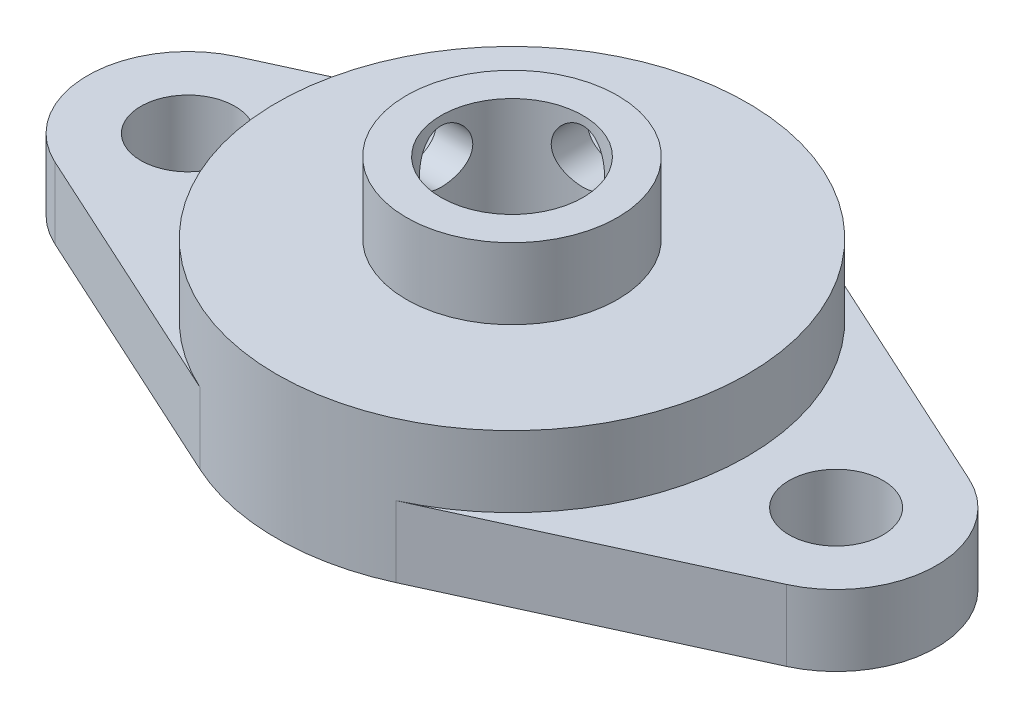
ISO-10303-21;
HEADER;
FILE_DESCRIPTION(('STEP AP214'),'2;1');
FILE_NAME('part.step','',(''),(''),'','','');
FILE_SCHEMA(('AUTOMOTIVE_DESIGN { 1 0 10303 214 1 1 1 1 }'));
ENDSEC;
DATA;
#1=APPLICATION_CONTEXT('core data for automotive mechanical design processes');
#2=APPLICATION_PROTOCOL_DEFINITION('international standard','automotive_design',2000,#1);
#3=PRODUCT_CONTEXT('',#1,'mechanical');
#4=PRODUCT('Part','Part','',(#3));
#5=PRODUCT_RELATED_PRODUCT_CATEGORY('part','',(#4));
#6=PRODUCT_DEFINITION_FORMATION('','',#4);
#7=PRODUCT_DEFINITION_CONTEXT('part definition',#1,'design');
#8=PRODUCT_DEFINITION('design','',#6,#7);
#9=PRODUCT_DEFINITION_SHAPE('','',#8);
#10=(LENGTH_UNIT() NAMED_UNIT(*) SI_UNIT(.MILLI.,.METRE.));
#11=(NAMED_UNIT(*) PLANE_ANGLE_UNIT() SI_UNIT($,.RADIAN.));
#12=(NAMED_UNIT(*) SI_UNIT($,.STERADIAN.) SOLID_ANGLE_UNIT());
#13=UNCERTAINTY_MEASURE_WITH_UNIT(LENGTH_MEASURE(1.E-05),#10,'distance_accuracy_value','');
#14=(GEOMETRIC_REPRESENTATION_CONTEXT(3) GLOBAL_UNCERTAINTY_ASSIGNED_CONTEXT((#13)) GLOBAL_UNIT_ASSIGNED_CONTEXT((#10,
#11,#12)) REPRESENTATION_CONTEXT('',''));
#15=CARTESIAN_POINT('',(0.,0.,0.));
#16=DIRECTION('',(0.,0.,1.));
#17=DIRECTION('',(1.,0.,0.));
#18=AXIS2_PLACEMENT_3D('',#15,#16,#17);
#19=CARTESIAN_POINT('',(0.,8.,0.));
#20=DIRECTION('',(0.,1.,0.));
#21=DIRECTION('',(0.,0.,1.));
#22=AXIS2_PLACEMENT_3D('',#19,#20,#21);
#23=PLANE('',#22);
#24=CARTESIAN_POINT('',(0.,8.,0.));
#25=DIRECTION('',(0.,1.,0.));
#26=DIRECTION('',(0.,0.,1.));
#27=AXIS2_PLACEMENT_3D('',#24,#25,#26);
#28=CIRCLE('',#27,13.25);
#29=CARTESIAN_POINT('',(0.,8.,13.25));
#30=VERTEX_POINT('',#29);
#31=EDGE_CURVE('E188',#30,#30,#28,.T.);
#32=ORIENTED_EDGE('',*,*,#31,.T.);
#33=EDGE_LOOP('',(#32));
#34=FACE_BOUND('',#33,.T.);
#35=CARTESIAN_POINT('',(0.,8.,0.));
#36=DIRECTION('',(0.,1.,0.));
#37=DIRECTION('',(0.,0.,1.));
#38=AXIS2_PLACEMENT_3D('',#35,#36,#37);
#39=CIRCLE('',#38,5.95);
#40=CARTESIAN_POINT('',(0.,8.,5.95));
#41=VERTEX_POINT('',#40);
#42=EDGE_CURVE('E270',#41,#41,#39,.T.);
#43=ORIENTED_EDGE('',*,*,#42,.F.);
#44=EDGE_LOOP('',(#43));
#45=FACE_BOUND('',#44,.T.);
#46=ADVANCED_FACE('F38',(#34,#45),#23,.T.);
#47=CARTESIAN_POINT('',(0.,8.,0.));
#48=DIRECTION('',(0.,-1.,0.));
#49=DIRECTION('',(0.,0.,-1.));
#50=AXIS2_PLACEMENT_3D('',#47,#48,#49);
#51=CYLINDRICAL_SURFACE('',#50,13.25);
#52=ORIENTED_EDGE('',*,*,#31,.F.);
#53=EDGE_LOOP('',(#52));
#54=FACE_BOUND('',#53,.T.);
#55=DIRECTION('',(0.,-1.,0.));
#56=VECTOR('',#55,1.);
#57=CARTESIAN_POINT('',(-5.51780821917808,4.,-12.0464223924106));
#58=LINE('',#57,#56);
#59=CARTESIAN_POINT('',(-5.51780821917808,4.,-12.0464223924106));
#60=VERTEX_POINT('',#59);
#61=CARTESIAN_POINT('',(-5.51780821917808,0.,-12.0464223924106));
#62=VERTEX_POINT('',#61);
#63=EDGE_CURVE('E121',#60,#62,#58,.T.);
#64=ORIENTED_EDGE('',*,*,#63,.F.);
#65=CARTESIAN_POINT('',(0.,4.,0.));
#66=DIRECTION('',(0.,1.,0.));
#67=DIRECTION('',(0.,0.,1.));
#68=AXIS2_PLACEMENT_3D('',#65,#66,#67);
#69=CIRCLE('',#68,13.25);
#70=CARTESIAN_POINT('',(-5.51780821917808,4.,12.0464223924106));
#71=VERTEX_POINT('',#70);
#72=EDGE_CURVE('E11',#60,#71,#69,.T.);
#73=ORIENTED_EDGE('',*,*,#72,.T.);
#74=DIRECTION('',(0.,-1.,0.));
#75=VECTOR('',#74,1.);
#76=CARTESIAN_POINT('',(-5.51780821917808,4.,12.0464223924106));
#77=LINE('',#76,#75);
#78=CARTESIAN_POINT('',(-5.51780821917833,0.,12.0464223924105));
#79=VERTEX_POINT('',#78);
#80=EDGE_CURVE('E277',#71,#79,#77,.T.);
#81=ORIENTED_EDGE('',*,*,#80,.T.);
#82=CARTESIAN_POINT('',(0.,0.,0.));
#83=DIRECTION('',(0.,1.,0.));
#84=DIRECTION('',(0.,0.,1.));
#85=AXIS2_PLACEMENT_3D('',#82,#83,#84);
#86=CIRCLE('',#85,13.25);
#87=CARTESIAN_POINT('',(5.51780821917817,0.,12.0464223924106));
#88=VERTEX_POINT('',#87);
#89=EDGE_CURVE('E187',#79,#88,#86,.T.);
#90=ORIENTED_EDGE('',*,*,#89,.T.);
#91=DIRECTION('',(0.,-1.,0.));
#92=VECTOR('',#91,1.);
#93=CARTESIAN_POINT('',(5.51780821917817,4.,12.0464223924106));
#94=LINE('',#93,#92);
#95=CARTESIAN_POINT('',(5.51780821917825,4.,12.0464223924105));
#96=VERTEX_POINT('',#95);
#97=EDGE_CURVE('E172',#96,#88,#94,.T.);
#98=ORIENTED_EDGE('',*,*,#97,.F.);
#99=CARTESIAN_POINT('',(0.,4.,0.));
#100=DIRECTION('',(0.,-1.,0.));
#101=DIRECTION('',(0.,0.,-1.));
#102=AXIS2_PLACEMENT_3D('',#99,#100,#101);
#103=CIRCLE('',#102,13.25);
#104=CARTESIAN_POINT('',(5.517808219178,4.,-12.0464223924106));
#105=VERTEX_POINT('',#104);
#106=EDGE_CURVE('E53',#105,#96,#103,.T.);
#107=ORIENTED_EDGE('',*,*,#106,.F.);
#108=DIRECTION('',(0.,-1.,0.));
#109=VECTOR('',#108,1.);
#110=CARTESIAN_POINT('',(5.517808219178,4.,-12.0464223924106));
#111=LINE('',#110,#109);
#112=CARTESIAN_POINT('',(5.517808219178,0.,-12.0464223924106));
#113=VERTEX_POINT('',#112);
#114=EDGE_CURVE('E176',#105,#113,#111,.T.);
#115=ORIENTED_EDGE('',*,*,#114,.T.);
#116=EDGE_CURVE('E130',#113,#62,#86,.T.);
#117=ORIENTED_EDGE('',*,*,#116,.T.);
#118=EDGE_LOOP('',(#64,#73,#81,#90,#98,#107,#115,#117));
#119=FACE_BOUND('',#118,.T.);
#120=ADVANCED_FACE('F40',(#54,#119),#51,.T.);
#121=CARTESIAN_POINT('',(0.,0.,0.));
#122=DIRECTION('',(0.,1.,0.));
#123=DIRECTION('',(0.,0.,1.));
#124=AXIS2_PLACEMENT_3D('',#121,#122,#123);
#125=PLANE('',#124);
#126=ORIENTED_EDGE('',*,*,#89,.F.);
#127=DIRECTION('',(0.909163954144185,0.,0.416438356164402));
#128=VECTOR('',#127,1.);
#129=CARTESIAN_POINT('',(-20.6028767123286,0.,5.13677634091438));
#130=LINE('',#129,#128);
#131=CARTESIAN_POINT('',(-20.6028767123287,0.,5.13677634091453));
#132=VERTEX_POINT('',#131);
#133=EDGE_CURVE('E61',#132,#79,#130,.T.);
#134=ORIENTED_EDGE('',*,*,#133,.F.);
#135=CARTESIAN_POINT('',(-18.25,0.,0.));
#136=DIRECTION('',(0.,1.,0.));
#137=DIRECTION('',(0.,0.,1.));
#138=AXIS2_PLACEMENT_3D('',#135,#136,#137);
#139=CIRCLE('',#138,5.64999999999984);
#140=CARTESIAN_POINT('',(-20.6028767123288,0.,-5.1367763409147));
#141=VERTEX_POINT('',#140);
#142=EDGE_CURVE('E279',#141,#132,#139,.T.);
#143=ORIENTED_EDGE('',*,*,#142,.F.);
#144=DIRECTION('',(-0.909163954144194,0.,0.416438356164384));
#145=VECTOR('',#144,1.);
#146=CARTESIAN_POINT('',(-20.6028767123288,0.,-5.1367763409147));
#147=LINE('',#146,#145);
#148=EDGE_CURVE('E266',#62,#141,#147,.T.);
#149=ORIENTED_EDGE('',*,*,#148,.F.);
#150=ORIENTED_EDGE('',*,*,#116,.F.);
#151=DIRECTION('',(-0.909163954144194,0.,-0.416438356164383));
#152=VECTOR('',#151,1.);
#153=CARTESIAN_POINT('',(20.6028767123287,0.,-5.1367763409147));
#154=LINE('',#153,#152);
#155=CARTESIAN_POINT('',(20.6028767123287,0.,-5.1367763409147));
#156=VERTEX_POINT('',#155);
#157=EDGE_CURVE('E164',#156,#113,#154,.T.);
#158=ORIENTED_EDGE('',*,*,#157,.F.);
#159=CARTESIAN_POINT('',(18.25,0.,0.));
#160=DIRECTION('',(0.,1.,0.));
#161=DIRECTION('',(0.,0.,-1.));
#162=AXIS2_PLACEMENT_3D('',#159,#160,#161);
#163=CIRCLE('',#162,5.6499999999999);
#164=CARTESIAN_POINT('',(20.6028767123288,0.,5.13677634091447));
#165=VERTEX_POINT('',#164);
#166=EDGE_CURVE('E147',#165,#156,#163,.T.);
#167=ORIENTED_EDGE('',*,*,#166,.F.);
#168=DIRECTION('',(0.909163954144188,0.,-0.416438356164396));
#169=VECTOR('',#168,1.);
#170=CARTESIAN_POINT('',(20.6028767123288,0.,5.13677634091447));
#171=LINE('',#170,#169);
#172=EDGE_CURVE('E154',#88,#165,#171,.T.);
#173=ORIENTED_EDGE('',*,*,#172,.F.);
#174=EDGE_LOOP('',(#126,#134,#143,#149,#150,#158,#167,#173));
#175=FACE_BOUND('',#174,.T.);
#176=CARTESIAN_POINT('',(0.,0.,0.));
#177=DIRECTION('',(0.,1.,0.));
#178=DIRECTION('',(0.,0.,1.));
#179=AXIS2_PLACEMENT_3D('',#176,#177,#178);
#180=CIRCLE('',#179,4.);
#181=CARTESIAN_POINT('',(0.,0.,4.));
#182=VERTEX_POINT('',#181);
#183=EDGE_CURVE('E183',#182,#182,#180,.T.);
#184=ORIENTED_EDGE('',*,*,#183,.T.);
#185=EDGE_LOOP('',(#184));
#186=FACE_BOUND('',#185,.T.);
#187=CARTESIAN_POINT('',(18.25,0.,0.));
#188=DIRECTION('',(0.,1.,0.));
#189=DIRECTION('',(0.,0.,-1.));
#190=AXIS2_PLACEMENT_3D('',#187,#188,#189);
#191=CIRCLE('',#190,2.65000000000001);
#192=CARTESIAN_POINT('',(18.25,0.,-2.65000000000001));
#193=VERTEX_POINT('',#192);
#194=EDGE_CURVE('E132',#193,#193,#191,.T.);
#195=ORIENTED_EDGE('',*,*,#194,.T.);
#196=EDGE_LOOP('',(#195));
#197=FACE_BOUND('',#196,.T.);
#198=CARTESIAN_POINT('',(-18.25,0.,0.));
#199=DIRECTION('',(0.,1.,0.));
#200=DIRECTION('',(0.,0.,1.));
#201=AXIS2_PLACEMENT_3D('',#198,#199,#200);
#202=CIRCLE('',#201,2.65);
#203=CARTESIAN_POINT('',(-18.25,0.,2.65));
#204=VERTEX_POINT('',#203);
#205=EDGE_CURVE('E258',#204,#204,#202,.T.);
#206=ORIENTED_EDGE('',*,*,#205,.T.);
#207=EDGE_LOOP('',(#206));
#208=FACE_BOUND('',#207,.T.);
#209=ADVANCED_FACE('F236',(#175,#186,#197,#208),#125,.F.);
#210=CARTESIAN_POINT('',(0.,8.,0.));
#211=DIRECTION('',(0.,-1.,0.));
#212=DIRECTION('',(0.,0.,-1.));
#213=AXIS2_PLACEMENT_3D('',#210,#211,#212);
#214=CYLINDRICAL_SURFACE('',#213,4.);
#215=CARTESIAN_POINT('',(-3.70809924354783,10.,-1.5));
#216=CARTESIAN_POINT('',(-3.70809640633806,10.0810074837208,-1.50000304106109));
#217=CARTESIAN_POINT('',(-3.71078260240986,10.1619949225036,-1.49341597549487));
#218=CARTESIAN_POINT('',(-3.72116159304967,10.3215280829132,-1.46736187895468));
#219=CARTESIAN_POINT('',(-3.72885423767112,10.400073877595,-1.44789523373263));
#220=CARTESIAN_POINT('',(-3.748254802809,10.5523753716135,-1.39689657610574));
#221=CARTESIAN_POINT('',(-3.7599530956926,10.6261420566511,-1.36539347266348));
#222=CARTESIAN_POINT('',(-3.78603134206598,10.7673718968188,-1.29131856742698));
#223=CARTESIAN_POINT('',(-3.80041210067323,10.8348331502825,-1.24874344095039));
#224=CARTESIAN_POINT('',(-3.83103574665713,10.9648903116228,-1.15146661374162));
#225=CARTESIAN_POINT('',(-3.84733341923603,11.0271285296294,-1.09630381213306));
#226=CARTESIAN_POINT('',(-3.87949750628547,11.1417228146715,-0.976395839778926));
#227=CARTESIAN_POINT('',(-3.89536382814785,11.1940767737419,-0.91164863025668));
#228=CARTESIAN_POINT('',(-3.92552873936553,11.2891395122956,-0.7716946551776));
#229=CARTESIAN_POINT('',(-3.93975561223505,11.3314594747159,-0.696206947538028));
#230=CARTESIAN_POINT('',(-3.96438007973848,11.4026511725249,-0.538555771965247));
#231=CARTESIAN_POINT('',(-3.97477900217006,11.431527571992,-0.456394630933536));
#232=CARTESIAN_POINT('',(-3.9901869710344,11.4737578957746,-0.291489341676832));
#233=CARTESIAN_POINT('',(-3.99540915214774,11.4877276274405,-0.208923197281597));
#234=CARTESIAN_POINT('',(-4.0006401410794,11.501721200945,-0.0424643637947865));
#235=CARTESIAN_POINT('',(-4.00065064414902,11.5017495776187,0.0414278850628325));
#236=CARTESIAN_POINT('',(-3.99559265903894,11.4882182385348,0.203743543064475));
#237=CARTESIAN_POINT('',(-3.99077541996683,11.4753307020512,0.282232178266899));
#238=CARTESIAN_POINT('',(-3.97693274932263,11.4374640847745,0.435839217984391));
#239=CARTESIAN_POINT('',(-3.96790701975578,11.412484147738,0.510957383430298));
#240=CARTESIAN_POINT('',(-3.94637769167531,11.3508295483242,0.656989017303104));
#241=CARTESIAN_POINT('',(-3.93382539470077,11.3139899947316,0.727825392287309));
#242=CARTESIAN_POINT('',(-3.90651310225279,11.2298079030706,0.86248660795756));
#243=CARTESIAN_POINT('',(-3.8917523951284,11.1824619769824,0.926309176932323));
#244=CARTESIAN_POINT('',(-3.86052529655816,11.0753727137168,1.04909048680094));
#245=CARTESIAN_POINT('',(-3.84400963763883,11.0150660843496,1.10754614526348));
#246=CARTESIAN_POINT('',(-3.81182460645722,10.8854070066785,1.21370395569342));
#247=CARTESIAN_POINT('',(-3.79615544748847,10.8160522934134,1.261403406929));
#248=CARTESIAN_POINT('',(-3.76712703500335,10.6682805325372,1.34565611808151));
#249=CARTESIAN_POINT('',(-3.75382677150277,10.5896965063139,1.38193847851831));
#250=CARTESIAN_POINT('',(-3.73172438629002,10.4269037748324,1.44056464441501));
#251=CARTESIAN_POINT('',(-3.72291976205783,10.3426982284063,1.46291620605595));
#252=CARTESIAN_POINT('',(-3.71139597222848,10.1760240376841,1.49190191709668));
#253=CARTESIAN_POINT('',(-3.70836785241537,10.0937158944639,1.49933521158966));
#254=CARTESIAN_POINT('',(-3.70786539525016,9.92899064325827,1.50057885636272));
#255=CARTESIAN_POINT('',(-3.71038967003987,9.84657356764754,1.49439261093762));
#256=CARTESIAN_POINT('',(-3.72039381629735,9.68807007771233,1.46929733520157));
#257=CARTESIAN_POINT('',(-3.72763276216449,9.61186886423535,1.45100618334225));
#258=CARTESIAN_POINT('',(-3.74596487046361,9.46365205527982,1.40299774640638));
#259=CARTESIAN_POINT('',(-3.75705882250173,9.39163732083188,1.37327812034623));
#260=CARTESIAN_POINT('',(-3.7823624311608,9.25083556192381,1.30200292275278));
#261=CARTESIAN_POINT('',(-3.79667328892065,9.18227070786267,1.26004545177047));
#262=CARTESIAN_POINT('',(-3.82662814294291,9.05287101827397,1.16591317862479));
#263=CARTESIAN_POINT('',(-3.84227262594077,8.99203902537538,1.11373463696435));
#264=CARTESIAN_POINT('',(-3.87433046553184,8.87583162680491,0.996727340900939));
#265=CARTESIAN_POINT('',(-3.89072969357027,8.82104659123126,0.931306341491062));
#266=CARTESIAN_POINT('',(-3.92149874963302,8.72316163241057,0.791797471753152));
#267=CARTESIAN_POINT('',(-3.93586857107664,8.68006174705417,0.717709573322674));
#268=CARTESIAN_POINT('',(-3.96094985704552,8.6070539438004,0.563016329468478));
#269=CARTESIAN_POINT('',(-3.9716738133801,8.57710087620741,0.482434433064629));
#270=CARTESIAN_POINT('',(-3.98829436712571,8.53134358615009,0.316881887523257));
#271=CARTESIAN_POINT('',(-3.99419323299412,8.51553271457761,0.231913320723595));
#272=CARTESIAN_POINT('',(-4.00028407317073,8.49922559724518,0.0653355852738168));
#273=CARTESIAN_POINT('',(-4.00078860953764,8.49789051694102,-0.0161807680608443));
#274=CARTESIAN_POINT('',(-3.99684889809224,8.5084151594454,-0.178226786412423));
#275=CARTESIAN_POINT('',(-3.9924052471313,8.52027329088587,-0.258756569245256));
#276=CARTESIAN_POINT('',(-3.97921089603771,8.55625885149363,-0.414548248377125));
#277=CARTESIAN_POINT('',(-3.97056791378017,8.58007990587836,-0.489890731068834));
#278=CARTESIAN_POINT('',(-3.9498778362099,8.63901001338437,-0.635515473006389));
#279=CARTESIAN_POINT('',(-3.93783009655664,8.67412120330476,-0.705796771275542));
#280=CARTESIAN_POINT('',(-3.91090618300074,8.75631394350482,-0.842540176994411));
#281=CARTESIAN_POINT('',(-3.89593240108828,8.80383664051416,-0.908717548846848));
#282=CARTESIAN_POINT('',(-3.86499507694844,8.90880783018761,-1.03241734752336));
#283=CARTESIAN_POINT('',(-3.84903118274027,8.96625986580788,-1.0899366712559));
#284=CARTESIAN_POINT('',(-3.81688129739175,9.09306413164507,-1.19781214236196));
#285=CARTESIAN_POINT('',(-3.8007280534916,9.16288440215432,-1.24762999816025));
#286=CARTESIAN_POINT('',(-3.77098325003638,9.31041586957333,-1.33484709556843));
#287=CARTESIAN_POINT('',(-3.75739195631216,9.38812788405349,-1.37224504878157));
#288=CARTESIAN_POINT('',(-3.73402269853266,9.55295568097541,-1.4346588697426));
#289=CARTESIAN_POINT('',(-3.7244380329086,9.64033436651179,-1.45906002899523));
#290=CARTESIAN_POINT('',(-3.71147994336315,9.8184852719558,-1.49172356722079));
#291=CARTESIAN_POINT('',(-3.70810242179736,9.90925521271,-1.49999659339571));
#292=CARTESIAN_POINT('',(-3.70809924354783,10.,-1.5));
#293=B_SPLINE_CURVE_WITH_KNOTS('',3,(#215,#216,#217,#218,#219,#220,#221,#222,#223,#224,#225,
#226,#227,#228,#229,#230,#231,#232,#233,#234,#235,#236,#237,#238,#239,#240,#241,#242,#243,#244,
#245,#246,#247,#248,#249,#250,#251,#252,#253,#254,#255,#256,#257,#258,#259,#260,#261,#262,#263,
#264,#265,#266,#267,#268,#269,#270,#271,#272,#273,#274,#275,#276,#277,#278,#279,#280,#281,#282,
#283,#284,#285,#286,#287,#288,#289,#290,#291,#292),.UNSPECIFIED.,.T.,.F.,(4,2,2,2,2,2,2,2,2,2,2,
2,2,2,2,2,2,2,2,2,2,2,2,2,2,2,2,2,2,2,2,2,2,2,2,2,2,2,4),(0.,0.242684541416169,
0.485361814598854,0.727459856757029,0.969630679682933,1.22274652401128,1.47591628822983,
1.73770072136421,1.9993942638133,2.24980018489679,2.50012465404857,2.73806472803194,
2.97602165263335,3.21744131210668,3.45893893628976,3.71456675065874,3.97025867827334,
4.23162592252966,4.49284751635474,4.73965657740485,4.98640395388884,5.22143845928199,
5.45652113429526,5.70041561005821,5.94439948466355,6.20385016993624,6.46330169650178,
6.72185508890168,6.98028685560127,7.22365720549936,7.4669982031948,7.70440274003891,
7.94185223512831,8.18928323676987,8.43680270894965,8.69738599542079,8.95799630544242,
9.23003178870926,9.50188762323054),.UNSPECIFIED.);
#294=CARTESIAN_POINT('',(-3.70809924354783,10.,-1.5));
#295=VERTEX_POINT('',#294);
#296=EDGE_CURVE('E203',#295,#295,#293,.T.);
#297=ORIENTED_EDGE('',*,*,#296,.F.);
#298=EDGE_LOOP('',(#297));
#299=FACE_BOUND('',#298,.T.);
#300=CARTESIAN_POINT('',(0.,11.5,-4.));
#301=CARTESIAN_POINT('',(-0.0812350589378528,11.5000029023031,-4.00000217456151));
#302=CARTESIAN_POINT('',(-0.162450241781792,11.4933802397516,-3.99750379283184));
#303=CARTESIAN_POINT('',(-0.322453452352361,11.4671718047301,-3.98778696006928));
#304=CARTESIAN_POINT('',(-0.401241827987615,11.4475878995294,-3.98056918893993));
#305=CARTESIAN_POINT('',(-0.554060784990879,11.3962469982282,-3.96218832391545));
#306=CARTESIAN_POINT('',(-0.628100224162279,11.3645134831782,-3.9510328434944));
#307=CARTESIAN_POINT('',(-0.769799310160254,11.2898935869842,-3.92588767765353));
#308=CARTESIAN_POINT('',(-0.837457239177879,11.2470042144559,-3.91189723227548));
#309=CARTESIAN_POINT('',(-0.967346417045825,11.1493874689291,-3.88186246971217));
#310=CARTESIAN_POINT('',(-1.02927073015119,11.0942697377406,-3.86576002583566));
#311=CARTESIAN_POINT('',(-1.14324421474363,10.9745895653412,-3.83360220871327));
#312=CARTESIAN_POINT('',(-1.19529036359203,10.9100242439121,-3.81754685135033));
#313=CARTESIAN_POINT('',(-1.28998202215985,10.7702825324768,-3.78662470617731));
#314=CARTESIAN_POINT('',(-1.3321939319576,10.6947956334542,-3.77182648820818));
#315=CARTESIAN_POINT('',(-1.40318646334084,10.5371516458315,-3.74599860237433));
#316=CARTESIAN_POINT('',(-1.43197244961239,10.4549972368449,-3.73496742975881));
#317=CARTESIAN_POINT('',(-1.47408431017549,10.2898832597418,-3.71854412824136));
#318=CARTESIAN_POINT('',(-1.48799593218558,10.2070949615646,-3.71293924350838));
#319=CARTESIAN_POINT('',(-1.50179556531648,10.0401838420062,-3.70738061461215));
#320=CARTESIAN_POINT('',(-1.5016893680263,9.95606158612554,-3.70742453659305));
#321=CARTESIAN_POINT('',(-1.48790429610018,9.79423047478705,-3.71297511632055));
#322=CARTESIAN_POINT('',(-1.47503808509003,9.71643909395583,-3.71815468871122));
#323=CARTESIAN_POINT('',(-1.4374416786833,9.56421284959469,-3.73284938059529));
#324=CARTESIAN_POINT('',(-1.41270969663258,9.48977849338613,-3.74236515298863));
#325=CARTESIAN_POINT('',(-1.35163748571904,9.34472293227178,-3.76485702190253));
#326=CARTESIAN_POINT('',(-1.31508648737101,9.27420051387871,-3.77789517988166));
#327=CARTESIAN_POINT('',(-1.23156073762698,9.14005426240904,-3.80594210139319));
#328=CARTESIAN_POINT('',(-1.18458238728897,9.07643282248031,-3.82095154457158));
#329=CARTESIAN_POINT('',(-1.07781780766549,8.95339633634913,-3.85248038859113));
#330=CARTESIAN_POINT('',(-1.01738298716956,8.89455135925192,-3.86903347455671));
#331=CARTESIAN_POINT('',(-0.887312590819021,8.78766203379421,-3.90091728164085));
#332=CARTESIAN_POINT('',(-0.817675603497365,8.73961934539434,-3.91624781465952));
#333=CARTESIAN_POINT('',(-0.66972343699242,8.65506960293749,-3.9442639480908));
#334=CARTESIAN_POINT('',(-0.591290713844719,8.61875241877895,-3.95690498259616));
#335=CARTESIAN_POINT('',(-0.428836850524583,8.56001739572997,-3.97778718326962));
#336=CARTESIAN_POINT('',(-0.344818210845767,8.53759338343889,-3.98603030341493));
#337=CARTESIAN_POINT('',(-0.178375243148665,8.50837721245807,-3.99684443228065));
#338=CARTESIAN_POINT('',(-0.0961036195622094,8.5008173936175,-3.99969369025686));
#339=CARTESIAN_POINT('',(0.068572475255024,8.49930893610009,-4.00025893700126));
#340=CARTESIAN_POINT('',(0.150976912983372,8.50535727968323,-3.99797606386863));
#341=CARTESIAN_POINT('',(0.310262048561859,8.53031004230868,-3.98871709772643));
#342=CARTESIAN_POINT('',(0.387233328007335,8.54871154373709,-3.98192470962305));
#343=CARTESIAN_POINT('',(0.53694175495722,8.59718607254733,-3.96451477091717));
#344=CARTESIAN_POINT('',(0.609678350347534,8.62726061794804,-3.9538967228203));
#345=CARTESIAN_POINT('',(0.751247765110155,8.69918641243948,-3.92949624407681));
#346=CARTESIAN_POINT('',(0.819903083557796,8.74135772922339,-3.91563000209348));
#347=CARTESIAN_POINT('',(0.949392711726626,8.83591810317157,-3.88626671564664));
#348=CARTESIAN_POINT('',(1.01022412027045,8.88831093254516,-3.87076907009516));
#349=CARTESIAN_POINT('',(1.12603079874454,9.00540412212428,-3.8387332949099));
#350=CARTESIAN_POINT('',(1.18046154123569,9.07064218277271,-3.82218696503729));
#351=CARTESIAN_POINT('',(1.27771050031903,9.20965138470766,-3.79078815746854));
#352=CARTESIAN_POINT('',(1.32052767414518,9.28342329138851,-3.77593583194399));
#353=CARTESIAN_POINT('',(1.39337773518998,9.43801598677232,-3.74966829822463));
#354=CARTESIAN_POINT('',(1.42335685446918,9.51886474591044,-3.73826760328493));
#355=CARTESIAN_POINT('',(1.46907883466889,9.68500976368783,-3.72054032891005));
#356=CARTESIAN_POINT('',(1.48483050305535,9.77030323619813,-3.71421061057491));
#357=CARTESIAN_POINT('',(1.50086347097839,9.93701615954112,-3.70775894792573));
#358=CARTESIAN_POINT('',(1.50207331495837,10.0183326317169,-3.70726444523341));
#359=CARTESIAN_POINT('',(1.49136715641593,10.1799453162762,-3.71158412745292));
#360=CARTESIAN_POINT('',(1.47945239850124,10.2602416246716,-3.71639780898899));
#361=CARTESIAN_POINT('',(1.44355815630242,10.4150472267166,-3.73048141585432));
#362=CARTESIAN_POINT('',(1.41995798316524,10.4896583462454,-3.73961085376663));
#363=CARTESIAN_POINT('',(1.3616969677992,10.6339055084944,-3.76121548297845));
#364=CARTESIAN_POINT('',(1.32703332944945,10.7035402880702,-3.77369151995215));
#365=CARTESIAN_POINT('',(1.24552075938154,10.8398267896976,-3.80139723903965));
#366=CARTESIAN_POINT('',(1.1981283280301,10.9061307967999,-3.81673698440964));
#367=CARTESIAN_POINT('',(1.09334485729906,11.0301415609712,-3.84806246757177));
#368=CARTESIAN_POINT('',(1.03595064012808,11.0878455747868,-3.86404840943145));
#369=CARTESIAN_POINT('',(0.909080396784623,11.1962019558219,-3.89590424609881));
#370=CARTESIAN_POINT('',(0.839118644212993,11.2463037534347,-3.91172104900645));
#371=CARTESIAN_POINT('',(0.691213223200821,11.3340226552766,-3.94054514457031));
#372=CARTESIAN_POINT('',(0.613268934090621,11.3716387877364,-3.95355221851559));
#373=CARTESIAN_POINT('',(0.447999082002311,11.4343768290483,-3.9757429260668));
#374=CARTESIAN_POINT('',(0.360413422234207,11.4588870646019,-3.98473657158356));
#375=CARTESIAN_POINT('',(0.181875733606381,11.4916929599207,-3.99686242179587));
#376=CARTESIAN_POINT('',(0.0909254163648585,11.4999967514873,-3.99999756603967));
#377=CARTESIAN_POINT('',(0.,11.5,-4.));
#378=B_SPLINE_CURVE_WITH_KNOTS('',3,(#300,#301,#302,#303,#304,#305,#306,#307,#308,#309,#310,
#311,#312,#313,#314,#315,#316,#317,#318,#319,#320,#321,#322,#323,#324,#325,#326,#327,#328,#329,
#330,#331,#332,#333,#334,#335,#336,#337,#338,#339,#340,#341,#342,#343,#344,#345,#346,#347,#348,
#349,#350,#351,#352,#353,#354,#355,#356,#357,#358,#359,#360,#361,#362,#363,#364,#365,#366,#367,
#368,#369,#370,#371,#372,#373,#374,#375,#376,#377),.UNSPECIFIED.,.T.,.F.,(4,2,2,2,2,2,2,2,2,2,2,
2,2,2,2,2,2,2,2,2,2,2,2,2,2,2,2,2,2,2,2,2,2,2,2,2,2,2,4),(0.,0.243369801560559,0.48670454953046,
0.729571369213574,0.972503379609489,1.22473618582715,1.47704604925622,1.73896674501658,
2.00078269352134,2.25185874416901,2.50283106079707,2.73878345119971,2.97477138060589,
3.21522408387018,3.45575990744258,3.71246153335813,3.96920257905066,4.22991375286075,
4.49050899698846,4.73725019635925,4.9839366839052,5.2211443792384,5.45838293254453,
5.702592218596,5.94689180019868,6.20536519455658,6.46386178920141,6.72343066727204,
6.98283874956507,7.22558763480252,7.46831350211259,7.70363142426534,7.93900886656506,
8.18672471884271,8.43451941997062,8.69572329654039,8.95694749805102,9.22948515032042,
9.50188601796127),.UNSPECIFIED.);
#379=CARTESIAN_POINT('',(0.,11.5,-4.));
#380=VERTEX_POINT('',#379);
#381=EDGE_CURVE('E202',#380,#380,#378,.T.);
#382=ORIENTED_EDGE('',*,*,#381,.F.);
#383=EDGE_LOOP('',(#382));
#384=FACE_BOUND('',#383,.T.);
#385=ORIENTED_EDGE('',*,*,#183,.F.);
#386=EDGE_LOOP('',(#385));
#387=FACE_BOUND('',#386,.T.);
#388=CARTESIAN_POINT('',(0.,12.,0.));
#389=DIRECTION('',(0.,1.,0.));
#390=DIRECTION('',(0.,0.,1.));
#391=AXIS2_PLACEMENT_3D('',#388,#389,#390);
#392=CIRCLE('',#391,4.);
#393=CARTESIAN_POINT('',(0.,12.,4.));
#394=VERTEX_POINT('',#393);
#395=EDGE_CURVE('E225',#394,#394,#392,.T.);
#396=ORIENTED_EDGE('',*,*,#395,.T.);
#397=EDGE_LOOP('',(#396));
#398=FACE_BOUND('',#397,.T.);
#399=ADVANCED_FACE('F230',(#299,#384,#387,#398),#214,.F.);
#400=CARTESIAN_POINT('',(18.25,4.,0.));
#401=DIRECTION('',(0.,-1.,0.));
#402=DIRECTION('',(0.,0.,-1.));
#403=AXIS2_PLACEMENT_3D('',#400,#401,#402);
#404=PLANE('',#403);
#405=DIRECTION('',(-0.909163954144194,0.,-0.416438356164383));
#406=VECTOR('',#405,1.);
#407=CARTESIAN_POINT('',(20.6028767123287,4.,-5.1367763409147));
#408=LINE('',#407,#406);
#409=CARTESIAN_POINT('',(20.6028767123287,4.,-5.1367763409147));
#410=VERTEX_POINT('',#409);
#411=EDGE_CURVE('E153',#410,#105,#408,.T.);
#412=ORIENTED_EDGE('',*,*,#411,.T.);
#413=ORIENTED_EDGE('',*,*,#106,.T.);
#414=DIRECTION('',(0.909163954144188,0.,-0.416438356164396));
#415=VECTOR('',#414,1.);
#416=CARTESIAN_POINT('',(20.6028767123288,4.,5.13677634091447));
#417=LINE('',#416,#415);
#418=CARTESIAN_POINT('',(20.6028767123288,4.,5.13677634091447));
#419=VERTEX_POINT('',#418);
#420=EDGE_CURVE('E157',#96,#419,#417,.T.);
#421=ORIENTED_EDGE('',*,*,#420,.T.);
#422=CARTESIAN_POINT('',(18.25,4.,0.));
#423=DIRECTION('',(0.,1.,0.));
#424=DIRECTION('',(0.,0.,-1.));
#425=AXIS2_PLACEMENT_3D('',#422,#423,#424);
#426=CIRCLE('',#425,5.6499999999999);
#427=EDGE_CURVE('E149',#419,#410,#426,.T.);
#428=ORIENTED_EDGE('',*,*,#427,.T.);
#429=EDGE_LOOP('',(#412,#413,#421,#428));
#430=FACE_BOUND('',#429,.T.);
#431=CARTESIAN_POINT('',(18.25,4.,0.));
#432=DIRECTION('',(0.,1.,0.));
#433=DIRECTION('',(0.,0.,-1.));
#434=AXIS2_PLACEMENT_3D('',#431,#432,#433);
#435=CIRCLE('',#434,2.65000000000001);
#436=CARTESIAN_POINT('',(18.25,4.,-2.65000000000001));
#437=VERTEX_POINT('',#436);
#438=EDGE_CURVE('E138',#437,#437,#435,.T.);
#439=ORIENTED_EDGE('',*,*,#438,.F.);
#440=EDGE_LOOP('',(#439));
#441=FACE_BOUND('',#440,.T.);
#442=ADVANCED_FACE('F235',(#430,#441),#404,.F.);
#443=CARTESIAN_POINT('',(18.25,4.,0.));
#444=DIRECTION('',(0.,-1.,0.));
#445=DIRECTION('',(0.,0.,-1.));
#446=AXIS2_PLACEMENT_3D('',#443,#444,#445);
#447=CYLINDRICAL_SURFACE('',#446,5.6499999999999);
#448=ORIENTED_EDGE('',*,*,#166,.T.);
#449=DIRECTION('',(0.,-1.,0.));
#450=VECTOR('',#449,1.);
#451=CARTESIAN_POINT('',(20.6028767123287,4.,-5.1367763409147));
#452=LINE('',#451,#450);
#453=EDGE_CURVE('E179',#410,#156,#452,.T.);
#454=ORIENTED_EDGE('',*,*,#453,.F.);
#455=ORIENTED_EDGE('',*,*,#427,.F.);
#456=DIRECTION('',(0.,-1.,0.));
#457=VECTOR('',#456,1.);
#458=CARTESIAN_POINT('',(20.6028767123288,4.,5.13677634091447));
#459=LINE('',#458,#457);
#460=EDGE_CURVE('E160',#419,#165,#459,.T.);
#461=ORIENTED_EDGE('',*,*,#460,.T.);
#462=EDGE_LOOP('',(#448,#454,#455,#461));
#463=FACE_BOUND('',#462,.T.);
#464=ADVANCED_FACE('F238',(#463),#447,.T.);
#465=CARTESIAN_POINT('',(20.6028767123287,4.,-5.1367763409147));
#466=DIRECTION('',(-0.416438356164383,0.,0.909163954144194));
#467=DIRECTION('',(0.909163954144194,0.,0.416438356164383));
#468=AXIS2_PLACEMENT_3D('',#465,#466,#467);
#469=PLANE('',#468);
#470=ORIENTED_EDGE('',*,*,#157,.T.);
#471=ORIENTED_EDGE('',*,*,#114,.F.);
#472=ORIENTED_EDGE('',*,*,#411,.F.);
#473=ORIENTED_EDGE('',*,*,#453,.T.);
#474=EDGE_LOOP('',(#470,#471,#472,#473));
#475=FACE_BOUND('',#474,.T.);
#476=ADVANCED_FACE('F312',(#475),#469,.F.);
#477=CARTESIAN_POINT('',(20.6028767123288,4.,5.13677634091447));
#478=DIRECTION('',(-0.416438356164396,0.,-0.909163954144188));
#479=DIRECTION('',(-0.909163954144188,0.,0.416438356164396));
#480=AXIS2_PLACEMENT_3D('',#477,#478,#479);
#481=PLANE('',#480);
#482=ORIENTED_EDGE('',*,*,#172,.T.);
#483=ORIENTED_EDGE('',*,*,#460,.F.);
#484=ORIENTED_EDGE('',*,*,#420,.F.);
#485=ORIENTED_EDGE('',*,*,#97,.T.);
#486=EDGE_LOOP('',(#482,#483,#484,#485));
#487=FACE_BOUND('',#486,.T.);
#488=ADVANCED_FACE('F306',(#487),#481,.F.);
#489=CARTESIAN_POINT('',(18.25,4.,0.));
#490=DIRECTION('',(0.,-1.,0.));
#491=DIRECTION('',(0.,0.,-1.));
#492=AXIS2_PLACEMENT_3D('',#489,#490,#491);
#493=CYLINDRICAL_SURFACE('',#492,2.65000000000001);
#494=ORIENTED_EDGE('',*,*,#438,.T.);
#495=EDGE_LOOP('',(#494));
#496=FACE_BOUND('',#495,.T.);
#497=ORIENTED_EDGE('',*,*,#194,.F.);
#498=EDGE_LOOP('',(#497));
#499=FACE_BOUND('',#498,.T.);
#500=ADVANCED_FACE('F303',(#496,#499),#493,.F.);
#501=CARTESIAN_POINT('',(-18.25,4.,0.));
#502=DIRECTION('',(0.,1.,0.));
#503=DIRECTION('',(0.,0.,1.));
#504=AXIS2_PLACEMENT_3D('',#501,#502,#503);
#505=PLANE('',#504);
#506=ORIENTED_EDGE('',*,*,#72,.F.);
#507=DIRECTION('',(-0.909163954144194,0.,0.416438356164384));
#508=VECTOR('',#507,1.);
#509=CARTESIAN_POINT('',(-20.6028767123288,4.,-5.1367763409147));
#510=LINE('',#509,#508);
#511=CARTESIAN_POINT('',(-20.6028767123288,4.,-5.1367763409147));
#512=VERTEX_POINT('',#511);
#513=EDGE_CURVE('E113',#60,#512,#510,.T.);
#514=ORIENTED_EDGE('',*,*,#513,.T.);
#515=CARTESIAN_POINT('',(-18.25,4.,0.));
#516=DIRECTION('',(0.,1.,0.));
#517=DIRECTION('',(0.,0.,1.));
#518=AXIS2_PLACEMENT_3D('',#515,#516,#517);
#519=CIRCLE('',#518,5.64999999999984);
#520=CARTESIAN_POINT('',(-20.6028767123287,4.,5.13677634091453));
#521=VERTEX_POINT('',#520);
#522=EDGE_CURVE('E127',#512,#521,#519,.T.);
#523=ORIENTED_EDGE('',*,*,#522,.T.);
#524=DIRECTION('',(0.909163954144185,0.,0.416438356164402));
#525=VECTOR('',#524,1.);
#526=CARTESIAN_POINT('',(-20.6028767123286,4.,5.13677634091438));
#527=LINE('',#526,#525);
#528=EDGE_CURVE('E116',#521,#71,#527,.T.);
#529=ORIENTED_EDGE('',*,*,#528,.T.);
#530=EDGE_LOOP('',(#506,#514,#523,#529));
#531=FACE_BOUND('',#530,.T.);
#532=CARTESIAN_POINT('',(-18.25,4.,0.));
#533=DIRECTION('',(0.,1.,0.));
#534=DIRECTION('',(0.,0.,1.));
#535=AXIS2_PLACEMENT_3D('',#532,#533,#534);
#536=CIRCLE('',#535,2.65);
#537=CARTESIAN_POINT('',(-18.25,4.,2.65));
#538=VERTEX_POINT('',#537);
#539=EDGE_CURVE('E260',#538,#538,#536,.T.);
#540=ORIENTED_EDGE('',*,*,#539,.F.);
#541=EDGE_LOOP('',(#540));
#542=FACE_BOUND('',#541,.T.);
#543=ADVANCED_FACE('F111',(#531,#542),#505,.T.);
#544=CARTESIAN_POINT('',(-20.6028767123288,4.,-5.1367763409147));
#545=DIRECTION('',(0.416438356164384,0.,0.909163954144194));
#546=DIRECTION('',(0.909163954144194,0.,-0.416438356164384));
#547=AXIS2_PLACEMENT_3D('',#544,#545,#546);
#548=PLANE('',#547);
#549=ORIENTED_EDGE('',*,*,#148,.T.);
#550=DIRECTION('',(0.,-1.,0.));
#551=VECTOR('',#550,1.);
#552=CARTESIAN_POINT('',(-20.6028767123288,4.,-5.1367763409147));
#553=LINE('',#552,#551);
#554=EDGE_CURVE('E124',#512,#141,#553,.T.);
#555=ORIENTED_EDGE('',*,*,#554,.F.);
#556=ORIENTED_EDGE('',*,*,#513,.F.);
#557=ORIENTED_EDGE('',*,*,#63,.T.);
#558=EDGE_LOOP('',(#549,#555,#556,#557));
#559=FACE_BOUND('',#558,.T.);
#560=ADVANCED_FACE('F120',(#559),#548,.F.);
#561=CARTESIAN_POINT('',(-18.25,4.,0.));
#562=DIRECTION('',(0.,-1.,0.));
#563=DIRECTION('',(0.,0.,-1.));
#564=AXIS2_PLACEMENT_3D('',#561,#562,#563);
#565=CYLINDRICAL_SURFACE('',#564,5.64999999999984);
#566=ORIENTED_EDGE('',*,*,#142,.T.);
#567=DIRECTION('',(0.,-1.,0.));
#568=VECTOR('',#567,1.);
#569=CARTESIAN_POINT('',(-20.6028767123287,4.,5.13677634091453));
#570=LINE('',#569,#568);
#571=EDGE_CURVE('E141',#521,#132,#570,.T.);
#572=ORIENTED_EDGE('',*,*,#571,.F.);
#573=ORIENTED_EDGE('',*,*,#522,.F.);
#574=ORIENTED_EDGE('',*,*,#554,.T.);
#575=EDGE_LOOP('',(#566,#572,#573,#574));
#576=FACE_BOUND('',#575,.T.);
#577=ADVANCED_FACE('F291',(#576),#565,.T.);
#578=CARTESIAN_POINT('',(-20.6028767123286,4.,5.13677634091438));
#579=DIRECTION('',(0.416438356164402,0.,-0.909163954144185));
#580=DIRECTION('',(-0.909163954144185,0.,-0.416438356164402));
#581=AXIS2_PLACEMENT_3D('',#578,#579,#580);
#582=PLANE('',#581);
#583=ORIENTED_EDGE('',*,*,#133,.T.);
#584=ORIENTED_EDGE('',*,*,#80,.F.);
#585=ORIENTED_EDGE('',*,*,#528,.F.);
#586=ORIENTED_EDGE('',*,*,#571,.T.);
#587=EDGE_LOOP('',(#583,#584,#585,#586));
#588=FACE_BOUND('',#587,.T.);
#589=ADVANCED_FACE('F288',(#588),#582,.F.);
#590=CARTESIAN_POINT('',(-18.25,4.,0.));
#591=DIRECTION('',(0.,-1.,0.));
#592=DIRECTION('',(0.,0.,-1.));
#593=AXIS2_PLACEMENT_3D('',#590,#591,#592);
#594=CYLINDRICAL_SURFACE('',#593,2.65);
#595=ORIENTED_EDGE('',*,*,#539,.T.);
#596=EDGE_LOOP('',(#595));
#597=FACE_BOUND('',#596,.T.);
#598=ORIENTED_EDGE('',*,*,#205,.F.);
#599=EDGE_LOOP('',(#598));
#600=FACE_BOUND('',#599,.T.);
#601=ADVANCED_FACE('F298',(#597,#600),#594,.F.);
#602=CARTESIAN_POINT('',(0.,12.,0.));
#603=DIRECTION('',(0.,1.,0.));
#604=DIRECTION('',(0.,0.,1.));
#605=AXIS2_PLACEMENT_3D('',#602,#603,#604);
#606=PLANE('',#605);
#607=CARTESIAN_POINT('',(0.,12.,0.));
#608=DIRECTION('',(0.,1.,0.));
#609=DIRECTION('',(0.,0.,1.));
#610=AXIS2_PLACEMENT_3D('',#607,#608,#609);
#611=CIRCLE('',#610,5.95);
#612=CARTESIAN_POINT('',(0.,12.,5.95));
#613=VERTEX_POINT('',#612);
#614=EDGE_CURVE('E261',#613,#613,#611,.T.);
#615=ORIENTED_EDGE('',*,*,#614,.T.);
#616=EDGE_LOOP('',(#615));
#617=FACE_BOUND('',#616,.T.);
#618=ORIENTED_EDGE('',*,*,#395,.F.);
#619=EDGE_LOOP('',(#618));
#620=FACE_BOUND('',#619,.T.);
#621=ADVANCED_FACE('F214',(#617,#620),#606,.T.);
#622=CARTESIAN_POINT('',(0.,12.,0.));
#623=DIRECTION('',(0.,-1.,0.));
#624=DIRECTION('',(0.,0.,-1.));
#625=AXIS2_PLACEMENT_3D('',#622,#623,#624);
#626=CYLINDRICAL_SURFACE('',#625,5.95);
#627=CARTESIAN_POINT('',(-5.75782076831157,10.,-1.5));
#628=CARTESIAN_POINT('',(-5.75782233494609,10.0828061649526,-1.49999768871238));
#629=CARTESIAN_POINT('',(-5.75962659429058,10.165637764115,-1.49311978240876));
#630=CARTESIAN_POINT('',(-5.7666298668346,10.3289206484312,-1.4658347600793));
#631=CARTESIAN_POINT('',(-5.77183082196396,10.4093705444182,-1.44541990472251));
#632=CARTESIAN_POINT('',(-5.7850018540609,10.5655045741877,-1.39176505830194));
#633=CARTESIAN_POINT('',(-5.79296831602232,10.6411947779117,-1.35854180384155));
#634=CARTESIAN_POINT('',(-5.81076822901485,10.7859358420616,-1.28026440234075));
#635=CARTESIAN_POINT('',(-5.82060176750092,10.854986391254,-1.23520970107067));
#636=CARTESIAN_POINT('',(-5.8412741714264,10.9860329856803,-1.13347144633303));
#637=CARTESIAN_POINT('',(-5.852129319229,11.047858561096,-1.07657158002437));
#638=CARTESIAN_POINT('',(-5.87348068088484,11.1611977701497,-0.953224007108163));
#639=CARTESIAN_POINT('',(-5.88397686066896,11.2127104272439,-0.886775397339862));
#640=CARTESIAN_POINT('',(-5.90360798591029,11.3046606401057,-0.745046980007372));
#641=CARTESIAN_POINT('',(-5.91272147754516,11.3449304831435,-0.669655135303469));
#642=CARTESIAN_POINT('',(-5.92837449499029,11.4121610690591,-0.512904027550644));
#643=CARTESIAN_POINT('',(-5.93491440715546,11.4391238098009,-0.431545662394264));
#644=CARTESIAN_POINT('',(-5.944568286417,11.478428097935,-0.266948406817761));
#645=CARTESIAN_POINT('',(-5.94775000410434,11.4910591919847,-0.183782699911667));
#646=CARTESIAN_POINT('',(-5.95056519154128,11.5022507642759,-0.0164559237692989));
#647=CARTESIAN_POINT('',(-5.95019919438891,11.5008133565232,0.0677049940231955));
#648=CARTESIAN_POINT('',(-5.94601052596882,11.4841164418582,0.232624117632467));
#649=CARTESIAN_POINT('',(-5.94226602741368,11.4691695085462,0.313416254189624));
#650=CARTESIAN_POINT('',(-5.93183226465853,11.4263805685082,0.471306468441187));
#651=CARTESIAN_POINT('',(-5.92514284223439,11.3985378689175,0.548404347404613));
#652=CARTESIAN_POINT('',(-5.90945172411485,11.3304964945648,0.697537874248504));
#653=CARTESIAN_POINT('',(-5.90042943091868,11.2901870923081,0.769520747132067));
#654=CARTESIAN_POINT('',(-5.88105044710892,11.1984406648317,0.905809634403647));
#655=CARTESIAN_POINT('',(-5.87069352097939,11.1470016745393,0.970114289987571));
#656=CARTESIAN_POINT('',(-5.84943692140127,11.0327826115147,1.09108572538245));
#657=CARTESIAN_POINT('',(-5.83853015514328,10.9697294600024,1.14749370224276));
#658=CARTESIAN_POINT('',(-5.81766341566799,10.8349446262213,1.24899361099793));
#659=CARTESIAN_POINT('',(-5.80770348826526,10.7632125243865,1.29408499549124));
#660=CARTESIAN_POINT('',(-5.78983234742103,10.612591786959,1.37184123304776));
#661=CARTESIAN_POINT('',(-5.78193163088578,10.5336691489972,1.40444280016486));
#662=CARTESIAN_POINT('',(-5.76920756152378,10.3712157198406,1.45583400038077));
#663=CARTESIAN_POINT('',(-5.76438353755494,10.2876859379591,1.47462664585967));
#664=CARTESIAN_POINT('',(-5.75850017235609,10.1207919199182,1.49743510422221));
#665=CARTESIAN_POINT('',(-5.75734326195708,10.0374834144613,1.50183399029071));
#666=CARTESIAN_POINT('',(-5.75865936105513,9.87132239473432,1.49677962599947));
#667=CARTESIAN_POINT('',(-5.76113203011554,9.78846983842996,1.48732767478012));
#668=CARTESIAN_POINT('',(-5.76933509320014,9.62700159452033,1.45517605430573));
#669=CARTESIAN_POINT('',(-5.77501038251313,9.54833825307391,1.43270030307497));
#670=CARTESIAN_POINT('',(-5.78892671981359,9.39589600588676,1.37538778324766));
#671=CARTESIAN_POINT('',(-5.79716807565594,9.32211768749821,1.34054953143309));
#672=CARTESIAN_POINT('',(-5.81549274421369,9.1799191873588,1.25870211192783));
#673=CARTESIAN_POINT('',(-5.82560946549267,9.11163494417298,1.21146441620507));
#674=CARTESIAN_POINT('',(-5.84646341851986,8.98382169560074,1.10644727101093));
#675=CARTESIAN_POINT('',(-5.8572007538335,8.92429415740596,1.04866605859182));
#676=CARTESIAN_POINT('',(-5.87841742128496,8.81412760660396,0.922442319036812));
#677=CARTESIAN_POINT('',(-5.88888319927538,8.76375385725043,0.853765566559674));
#678=CARTESIAN_POINT('',(-5.90809451049535,8.67525354560697,0.70870584679387));
#679=CARTESIAN_POINT('',(-5.91684013381929,8.63712634182874,0.63232328342005));
#680=CARTESIAN_POINT('',(-5.93157038923435,8.57453510167376,0.474550020021313));
#681=CARTESIAN_POINT('',(-5.93757493855685,8.54997222088232,0.393200480838868));
#682=CARTESIAN_POINT('',(-5.94623375048927,8.51491126434764,0.227356564063107));
#683=CARTESIAN_POINT('',(-5.94888867131996,8.50441042530947,0.142862807686706));
#684=CARTESIAN_POINT('',(-5.95052170309761,8.49792926093418,-0.024380782505345));
#685=CARTESIAN_POINT('',(-5.94959886746453,8.50155776439545,-0.107114717761272));
#686=CARTESIAN_POINT('',(-5.94440026733245,8.52233480837992,-0.270753753592761));
#687=CARTESIAN_POINT('',(-5.94012460564403,8.53948293433943,-0.35165891016747));
#688=CARTESIAN_POINT('',(-5.92871663200681,8.58660120238175,-0.508926820324036));
#689=CARTESIAN_POINT('',(-5.9216003306315,8.61649954445729,-0.585312322854411));
#690=CARTESIAN_POINT('',(-5.90525977473839,8.68820456280269,-0.732025921925321));
#691=CARTESIAN_POINT('',(-5.89603525062704,8.73001276224006,-0.802353242177573));
#692=CARTESIAN_POINT('',(-5.87619190076882,8.82553778839853,-0.936804832205173));
#693=CARTESIAN_POINT('',(-5.86554464290918,8.87951928209211,-1.00073686496424));
#694=CARTESIAN_POINT('',(-5.84418209657475,8.99734616967058,-1.11876772120989));
#695=CARTESIAN_POINT('',(-5.83346679146906,9.06119407147922,-1.17286403694311));
#696=CARTESIAN_POINT('',(-5.81294857955095,9.19840586566363,-1.27070101081858));
#697=CARTESIAN_POINT('',(-5.80316695036892,9.27192790909912,-1.31422468836178));
#698=CARTESIAN_POINT('',(-5.78591158942593,9.42548182868026,-1.38822949660823));
#699=CARTESIAN_POINT('',(-5.77843620002403,9.50550897667456,-1.41872000118598));
#700=CARTESIAN_POINT('',(-5.76779217545035,9.65448098960836,-1.46132037834492));
#701=CARTESIAN_POINT('',(-5.76408129197266,9.72272085703776,-1.47579332540437));
#702=CARTESIAN_POINT('',(-5.7590950369232,9.86063456266477,-1.4951336837741));
#703=CARTESIAN_POINT('',(-5.75781944979301,9.93030827339498,-1.50000194523711));
#704=CARTESIAN_POINT('',(-5.75782076831157,10.,-1.5));
#705=B_SPLINE_CURVE_WITH_KNOTS('',3,(#627,#628,#629,#630,#631,#632,#633,#634,#635,#636,#637,
#638,#639,#640,#641,#642,#643,#644,#645,#646,#647,#648,#649,#650,#651,#652,#653,#654,#655,#656,
#657,#658,#659,#660,#661,#662,#663,#664,#665,#666,#667,#668,#669,#670,#671,#672,#673,#674,#675,
#676,#677,#678,#679,#680,#681,#682,#683,#684,#685,#686,#687,#688,#689,#690,#691,#692,#693,#694,
#695,#696,#697,#698,#699,#700,#701,#702,#703,#704),.UNSPECIFIED.,.T.,.F.,(4,2,2,2,2,2,2,2,2,2,2,
2,2,2,2,2,2,2,2,2,2,2,2,2,2,2,2,2,2,2,2,2,2,2,2,2,2,2,4),(0.,0.24816252440501,0.496467050509526,
0.744448213372956,0.992440994683891,1.24543802607959,1.49845900277979,1.75507407358384,
2.01165060571106,2.26294561163234,2.51420285724788,2.75979145951352,3.00539325831315,
3.25324234223003,3.50113522287185,3.75584806293773,4.01057322149467,4.26657252022556,
4.52251595678711,4.77158985386634,5.02064039053487,5.26553095551585,5.51045091171654,
5.76024757088363,6.01008603608886,6.26629324643614,6.52248703416231,6.77678841394288,
7.03103981429034,7.27830297848153,7.52555856092682,7.77143979209798,8.01735248347587,
8.2692402221725,8.5211920933801,8.77794514182155,9.03451321327095,9.24339145154696,
9.45225120026682),.UNSPECIFIED.);
#706=CARTESIAN_POINT('',(-5.75782076831157,10.,-1.5));
#707=VERTEX_POINT('',#706);
#708=EDGE_CURVE('E42',#707,#707,#705,.T.);
#709=ORIENTED_EDGE('',*,*,#708,.T.);
#710=EDGE_LOOP('',(#709));
#711=FACE_BOUND('',#710,.T.);
#712=CARTESIAN_POINT('',(0.,11.5,-5.95));
#713=CARTESIAN_POINT('',(-0.0828533449426828,11.4999977162643,-5.94999861462193));
#714=CARTESIAN_POINT('',(-0.165732066241456,11.4931122396551,-5.94825219326225));
#715=CARTESIAN_POINT('',(-0.329112702250426,11.4657944271009,-5.9414546437251));
#716=CARTESIAN_POINT('',(-0.409613268856678,11.4453545558639,-5.93640167736133));
#717=CARTESIAN_POINT('',(-0.565854767200857,11.3916266073997,-5.92355035081917));
#718=CARTESIAN_POINT('',(-0.641601337896256,11.3583540998166,-5.91575531855186));
#719=CARTESIAN_POINT('',(-0.78643789958945,11.2799605016682,-5.89824924963315));
#720=CARTESIAN_POINT('',(-0.855527638513447,11.2348389626572,-5.88853814046821));
#721=CARTESIAN_POINT('',(-0.986534426544821,11.1330313288412,-5.86802636948526));
#722=CARTESIAN_POINT('',(-1.0482924101571,11.0761439703408,-5.85720867121787));
#723=CARTESIAN_POINT('',(-1.16149990412369,10.9528503440912,-5.83581565661008));
#724=CARTESIAN_POINT('',(-1.21294823128529,10.8864429852732,-5.82524036821317));
#725=CARTESIAN_POINT('',(-1.30482744940044,10.7447550932014,-5.80535748168527));
#726=CARTESIAN_POINT('',(-1.34507978354078,10.6693554638581,-5.79607149538028));
#727=CARTESIAN_POINT('',(-1.41227590388242,10.5125876879182,-5.78006730916444));
#728=CARTESIAN_POINT('',(-1.43922185731498,10.4312205157458,-5.77334869114261));
#729=CARTESIAN_POINT('',(-1.47849647367068,10.2665780076241,-5.76341514224191));
#730=CARTESIAN_POINT('',(-1.49111143638917,10.1833751975718,-5.76013169441098));
#731=CARTESIAN_POINT('',(-1.50225785800818,10.0159744153037,-5.75723520534081));
#732=CARTESIAN_POINT('',(-1.50079164935871,9.93177661020952,-5.75762155622432));
#733=CARTESIAN_POINT('',(-1.4840456352833,9.766975077974,-5.761959454869));
#734=CARTESIAN_POINT('',(-1.46910763117428,9.68633393361575,-5.76582278116662));
#735=CARTESIAN_POINT('',(-1.42638757840124,9.52874091610492,-5.77653865419827));
#736=CARTESIAN_POINT('',(-1.39860460097319,9.45178931017091,-5.78339141708341));
#737=CARTESIAN_POINT('',(-1.33069355269448,9.30284636301757,-5.79939458551628));
#738=CARTESIAN_POINT('',(-1.29044195373653,9.23091389919318,-5.80856780541801));
#739=CARTESIAN_POINT('',(-1.19882262336723,9.09470207494401,-5.82816549329189));
#740=CARTESIAN_POINT('',(-1.14745291661526,9.03042407762894,-5.83859018346447));
#741=CARTESIAN_POINT('',(-1.03328788045325,8.90938778532915,-5.85988714910893));
#742=CARTESIAN_POINT('',(-0.970204285070047,8.85290178578618,-5.87076363506633));
#743=CARTESIAN_POINT('',(-0.835329214535837,8.7512583235273,-5.89146611879313));
#744=CARTESIAN_POINT('',(-0.763537464589529,8.70610121844503,-5.90129208339377));
#745=CARTESIAN_POINT('',(-0.612891405664465,8.62829497724202,-5.91883666310488));
#746=CARTESIAN_POINT('',(-0.534012992722821,8.59569068946806,-5.92654769434254));
#747=CARTESIAN_POINT('',(-0.371656912351023,8.5442809847387,-5.93893847470975));
#748=CARTESIAN_POINT('',(-0.288180143388541,8.5254728823711,-5.94361881373937));
#749=CARTESIAN_POINT('',(-0.121324507734141,8.50260672614801,-5.94933333187149));
#750=CARTESIAN_POINT('',(-0.0379995102925236,8.49817793590459,-5.95045913472164));
#751=CARTESIAN_POINT('',(0.128201255149382,8.50317842980815,-5.94919899673395));
#752=CARTESIAN_POINT('',(0.211077063618055,8.51260644401438,-5.94681337770893));
#753=CARTESIAN_POINT('',(0.3727343348615,8.54474750887218,-5.93885722089723));
#754=CARTESIAN_POINT('',(0.451558732283363,8.56725775001532,-5.93333533271614));
#755=CARTESIAN_POINT('',(0.604308058437251,8.62469215772351,-5.91972947442902));
#756=CARTESIAN_POINT('',(0.678232486676758,8.65961759008952,-5.9116452430863));
#757=CARTESIAN_POINT('',(0.820554232706768,8.74160567332193,-5.89359258566797));
#758=CARTESIAN_POINT('',(0.888828289862872,8.78887524055543,-5.88359289819012));
#759=CARTESIAN_POINT('',(1.01660653252725,8.8939458413572,-5.86286691493244));
#760=CARTESIAN_POINT('',(1.07610917428585,8.95174872477223,-5.85214049173244));
#761=CARTESIAN_POINT('',(1.18618757179685,9.07796763435055,-5.83083925084796));
#762=CARTESIAN_POINT('',(1.23650306821473,9.14661279610901,-5.82027492142281));
#763=CARTESIAN_POINT('',(1.3249010103069,9.29159043521276,-5.80079254890437));
#764=CARTESIAN_POINT('',(1.36298399668354,9.36792257258181,-5.79187443305244));
#765=CARTESIAN_POINT('',(1.42555153753445,9.52570052252791,-5.7767931448565));
#766=CARTESIAN_POINT('',(1.45011659935051,9.60711277302954,-5.77061370592663));
#767=CARTESIAN_POINT('',(1.4851608173525,9.77309170538449,-5.76169510521885));
#768=CARTESIAN_POINT('',(1.49564311633955,9.8576576791014,-5.75895517586654));
#769=CARTESIAN_POINT('',(1.50205796305566,10.0248932052897,-5.75728502437759));
#770=CARTESIAN_POINT('',(1.4984067593366,10.1075459560975,-5.75824580764836));
#771=CARTESIAN_POINT('',(1.47761248222026,10.2710164217267,-5.76361643325202));
#772=CARTESIAN_POINT('',(1.46046968887934,10.3518341746029,-5.76802620399135));
#773=CARTESIAN_POINT('',(1.41340795772449,10.5088791942903,-5.77973666910845));
#774=CARTESIAN_POINT('',(1.38356833701192,10.5851316622837,-5.78701939587597));
#775=CARTESIAN_POINT('',(1.31202256396924,10.7316028193829,-5.80365744800581));
#776=CARTESIAN_POINT('',(1.27031473839236,10.8018206558733,-5.81301306557483));
#777=CARTESIAN_POINT('',(1.17491686306932,10.9362377581564,-5.83305252292516));
#778=CARTESIAN_POINT('',(1.12093857252154,11.000228220172,-5.8437649907133));
#779=CARTESIAN_POINT('',(1.00309206134443,11.118378366001,-5.86514161337317));
#780=CARTESIAN_POINT('',(0.939221489372011,11.1725357058675,-5.8758057561364));
#781=CARTESIAN_POINT('',(0.801977171299969,11.2704603234166,-5.89611968626861));
#782=CARTESIAN_POINT('',(0.728449459661929,11.3140168209217,-5.90574705499986));
#783=CARTESIAN_POINT('',(0.574878751624967,11.388081546338,-5.92266516328816));
#784=CARTESIAN_POINT('',(0.494840412681262,11.4185990058478,-5.92995755508193));
#785=CARTESIAN_POINT('',(0.345802684926788,11.4612563744378,-5.9403224211435));
#786=CARTESIAN_POINT('',(0.277505335220769,11.4757535477404,-5.9439264011723));
#787=CARTESIAN_POINT('',(0.139477910153431,11.4951259471581,-5.94876568150222));
#788=CARTESIAN_POINT('',(0.0697479467812254,11.5000019225039,-5.95000116624472));
#789=CARTESIAN_POINT('',(0.,11.5,-5.95));
#790=B_SPLINE_CURVE_WITH_KNOTS('',3,(#712,#713,#714,#715,#716,#717,#718,#719,#720,#721,#722,
#723,#724,#725,#726,#727,#728,#729,#730,#731,#732,#733,#734,#735,#736,#737,#738,#739,#740,#741,
#742,#743,#744,#745,#746,#747,#748,#749,#750,#751,#752,#753,#754,#755,#756,#757,#758,#759,#760,
#761,#762,#763,#764,#765,#766,#767,#768,#769,#770,#771,#772,#773,#774,#775,#776,#777,#778,#779,
#780,#781,#782,#783,#784,#785,#786,#787,#788,#789),.UNSPECIFIED.,.T.,.F.,(4,2,2,2,2,2,2,2,2,2,2,
2,2,2,2,2,2,2,2,2,2,2,2,2,2,2,2,2,2,2,2,2,2,2,2,2,2,2,4),(0.,0.248304411898378,
0.496746979475103,0.74488905889079,0.99304053099595,1.24585216658546,1.49869279962867,
1.75536063286634,2.01198664840924,2.26339038415166,2.51475247729785,2.75991115894788,
3.0050875697266,3.25277516172752,3.50050679625782,3.75542631013665,4.01035387037202,
4.26618395854972,4.5219642364605,4.77109516683604,5.02020326642142,5.26554880978221,
5.51091937472601,5.76070124886944,6.01052703171777,6.26659631874324,6.52265428541648,
6.77717029742497,7.03162950054174,7.27865240714033,7.52567018621022,7.77116699084958,
8.01669842418267,8.26873647018991,8.52083451651292,8.77759696000505,9.03417731403344,
9.24322224439979,9.45225089518767),.UNSPECIFIED.);
#791=CARTESIAN_POINT('',(0.,11.5,-5.95));
#792=VERTEX_POINT('',#791);
#793=EDGE_CURVE('E195',#792,#792,#790,.T.);
#794=ORIENTED_EDGE('',*,*,#793,.T.);
#795=EDGE_LOOP('',(#794));
#796=FACE_BOUND('',#795,.T.);
#797=ORIENTED_EDGE('',*,*,#614,.F.);
#798=EDGE_LOOP('',(#797));
#799=FACE_BOUND('',#798,.T.);
#800=ORIENTED_EDGE('',*,*,#42,.T.);
#801=EDGE_LOOP('',(#800));
#802=FACE_BOUND('',#801,.T.);
#803=ADVANCED_FACE('F204',(#711,#796,#799,#802),#626,.T.);
#804=CARTESIAN_POINT('',(0.,10.,-13.25));
#805=DIRECTION('',(0.,0.,1.));
#806=DIRECTION('',(1.,0.,0.));
#807=AXIS2_PLACEMENT_3D('',#804,#805,#806);
#808=CYLINDRICAL_SURFACE('',#807,1.5);
#809=ORIENTED_EDGE('',*,*,#381,.T.);
#810=EDGE_LOOP('',(#809));
#811=FACE_BOUND('',#810,.T.);
#812=ORIENTED_EDGE('',*,*,#793,.F.);
#813=EDGE_LOOP('',(#812));
#814=FACE_BOUND('',#813,.T.);
#815=ADVANCED_FACE('F208',(#811,#814),#808,.F.);
#816=CARTESIAN_POINT('',(-23.8999999999998,10.,0.));
#817=DIRECTION('',(1.,0.,0.));
#818=DIRECTION('',(0.,0.,-1.));
#819=AXIS2_PLACEMENT_3D('',#816,#817,#818);
#820=CYLINDRICAL_SURFACE('',#819,1.5);
#821=ORIENTED_EDGE('',*,*,#296,.T.);
#822=EDGE_LOOP('',(#821));
#823=FACE_BOUND('',#822,.T.);
#824=ORIENTED_EDGE('',*,*,#708,.F.);
#825=EDGE_LOOP('',(#824));
#826=FACE_BOUND('',#825,.T.);
#827=ADVANCED_FACE('F211',(#823,#826),#820,.F.);
#828=CLOSED_SHELL('',(#46,#120,#209,#399,#442,#464,#476,#488,#500,#543,#560,#577,#589,#601,#621,
#803,#815,#827));
#829=MANIFOLD_SOLID_BREP('B2',#828);
#830=ADVANCED_BREP_SHAPE_REPRESENTATION('',(#18,#829),#14);
#831=SHAPE_DEFINITION_REPRESENTATION(#9,#830);
ENDSEC;
END-ISO-10303-21;
